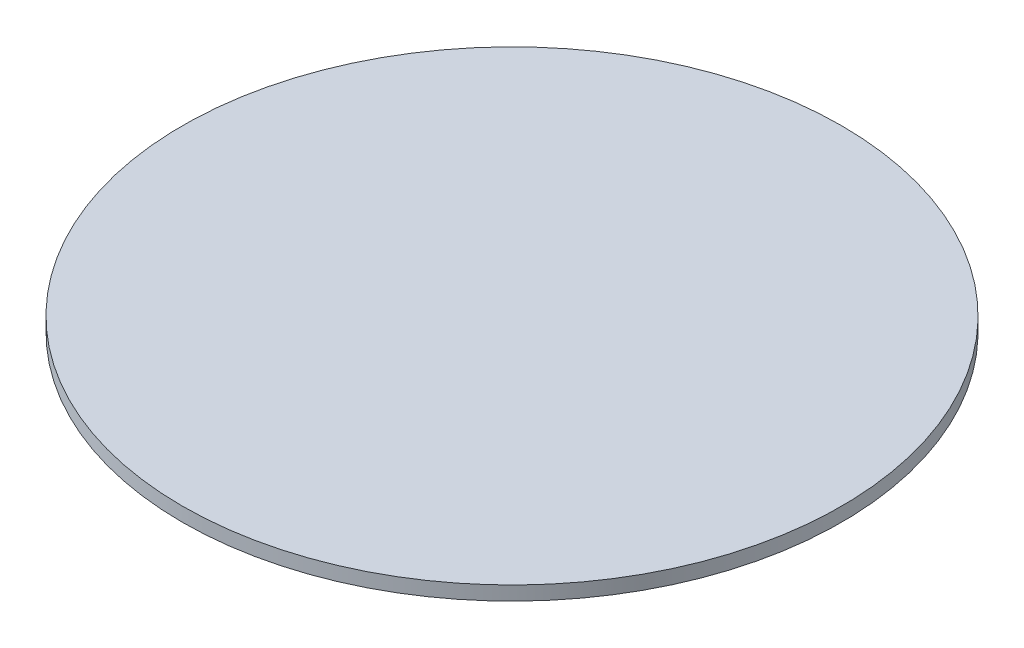
ISO-10303-21;
HEADER;
FILE_DESCRIPTION(('STEP AP214'),'2;1');
FILE_NAME('part.step','',(''),(''),'','','');
FILE_SCHEMA(('AUTOMOTIVE_DESIGN { 1 0 10303 214 1 1 1 1 }'));
ENDSEC;
DATA;
#1=APPLICATION_CONTEXT('core data for automotive mechanical design processes');
#2=APPLICATION_PROTOCOL_DEFINITION('international standard','automotive_design',2000,#1);
#3=PRODUCT_CONTEXT('',#1,'mechanical');
#4=PRODUCT('Part','Part','',(#3));
#5=PRODUCT_RELATED_PRODUCT_CATEGORY('part','',(#4));
#6=PRODUCT_DEFINITION_FORMATION('','',#4);
#7=PRODUCT_DEFINITION_CONTEXT('part definition',#1,'design');
#8=PRODUCT_DEFINITION('design','',#6,#7);
#9=PRODUCT_DEFINITION_SHAPE('','',#8);
#10=(LENGTH_UNIT() NAMED_UNIT(*) SI_UNIT(.MILLI.,.METRE.));
#11=(NAMED_UNIT(*) PLANE_ANGLE_UNIT() SI_UNIT($,.RADIAN.));
#12=(NAMED_UNIT(*) SI_UNIT($,.STERADIAN.) SOLID_ANGLE_UNIT());
#13=UNCERTAINTY_MEASURE_WITH_UNIT(LENGTH_MEASURE(1.E-05),#10,'distance_accuracy_value','');
#14=(GEOMETRIC_REPRESENTATION_CONTEXT(3) GLOBAL_UNCERTAINTY_ASSIGNED_CONTEXT((#13)) GLOBAL_UNIT_ASSIGNED_CONTEXT((#10,
#11,#12)) REPRESENTATION_CONTEXT('',''));
#15=CARTESIAN_POINT('',(0.,0.,0.));
#16=DIRECTION('',(0.,0.,1.));
#17=DIRECTION('',(1.,0.,0.));
#18=AXIS2_PLACEMENT_3D('',#15,#16,#17);
#19=CARTESIAN_POINT('',(0.,1.275,0.));
#20=DIRECTION('',(0.,-1.,0.));
#21=DIRECTION('',(0.,0.,-1.));
#22=AXIS2_PLACEMENT_3D('',#19,#20,#21);
#23=CYLINDRICAL_SURFACE('',#22,20.);
#24=CARTESIAN_POINT('',(0.,1.275,0.));
#25=DIRECTION('',(0.,1.,0.));
#26=DIRECTION('',(0.,0.,1.));
#27=AXIS2_PLACEMENT_3D('',#24,#25,#26);
#28=CIRCLE('',#27,20.);
#29=CARTESIAN_POINT('',(0.,1.275,20.));
#30=VERTEX_POINT('',#29);
#31=EDGE_CURVE('E10',#30,#30,#28,.T.);
#32=ORIENTED_EDGE('',*,*,#31,.F.);
#33=EDGE_LOOP('',(#32));
#34=FACE_BOUND('',#33,.T.);
#35=CARTESIAN_POINT('',(0.,0.425,0.));
#36=DIRECTION('',(0.,1.,0.));
#37=DIRECTION('',(0.,0.,1.));
#38=AXIS2_PLACEMENT_3D('',#35,#36,#37);
#39=CIRCLE('',#38,20.);
#40=CARTESIAN_POINT('',(0.,0.425,20.));
#41=VERTEX_POINT('',#40);
#42=EDGE_CURVE('E36',#41,#41,#39,.T.);
#43=ORIENTED_EDGE('',*,*,#42,.T.);
#44=EDGE_LOOP('',(#43));
#45=FACE_BOUND('',#44,.T.);
#46=ADVANCED_FACE('F33',(#34,#45),#23,.T.);
#47=CARTESIAN_POINT('',(0.,1.275,0.));
#48=DIRECTION('',(0.,1.,0.));
#49=DIRECTION('',(0.,0.,1.));
#50=AXIS2_PLACEMENT_3D('',#47,#48,#49);
#51=PLANE('',#50);
#52=ORIENTED_EDGE('',*,*,#31,.T.);
#53=EDGE_LOOP('',(#52));
#54=FACE_BOUND('',#53,.T.);
#55=ADVANCED_FACE('F48',(#54),#51,.T.);
#56=CARTESIAN_POINT('',(0.,0.425,0.));
#57=DIRECTION('',(0.,1.,0.));
#58=DIRECTION('',(0.,0.,1.));
#59=AXIS2_PLACEMENT_3D('',#56,#57,#58);
#60=PLANE('',#59);
#61=ORIENTED_EDGE('',*,*,#42,.F.);
#62=EDGE_LOOP('',(#61));
#63=FACE_BOUND('',#62,.T.);
#64=ADVANCED_FACE('F46',(#63),#60,.F.);
#65=CLOSED_SHELL('',(#46,#55,#64));
#66=MANIFOLD_SOLID_BREP('B2',#65);
#67=ADVANCED_BREP_SHAPE_REPRESENTATION('',(#18,#66),#14);
#68=SHAPE_DEFINITION_REPRESENTATION(#9,#67);
ENDSEC;
END-ISO-10303-21;
